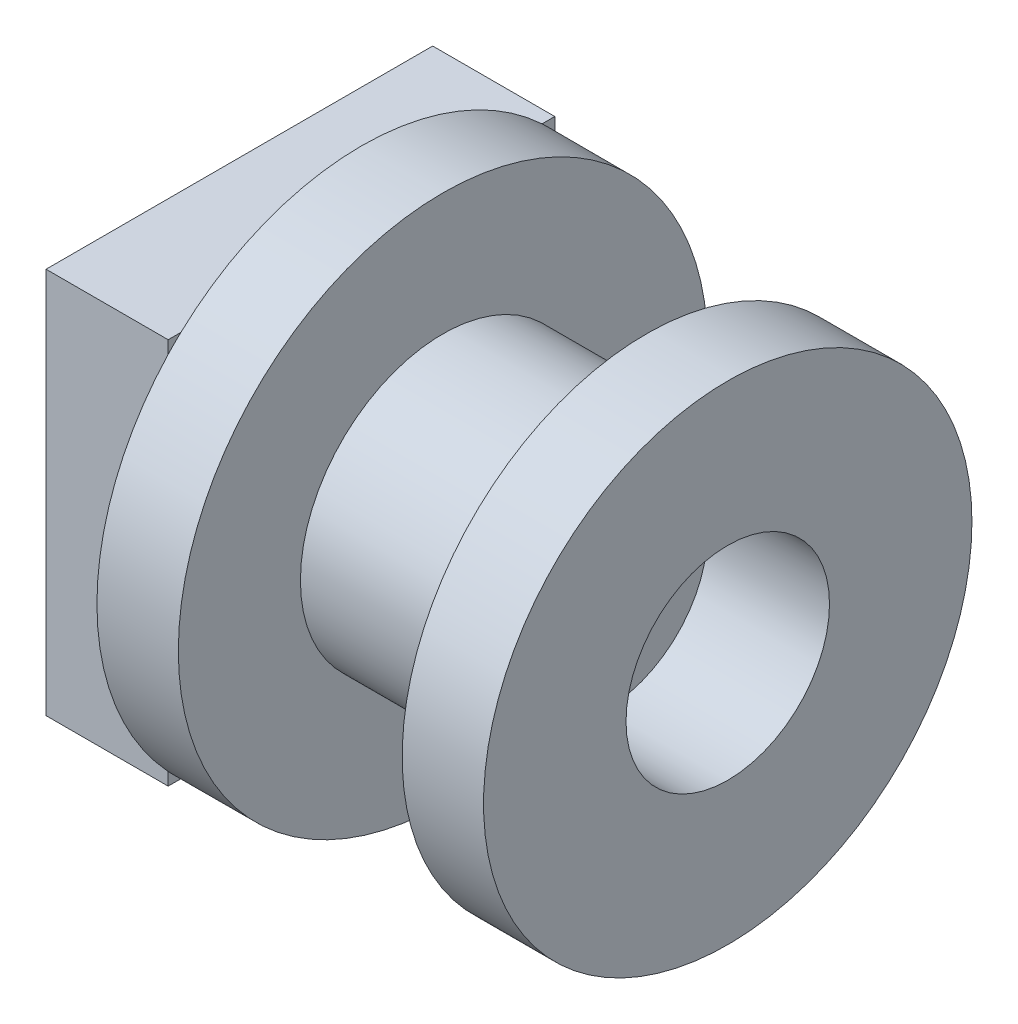
ISO-10303-21;
HEADER;
FILE_DESCRIPTION(('STEP AP214'),'2;1');
FILE_NAME('part.step','',(''),(''),'','','');
FILE_SCHEMA(('AUTOMOTIVE_DESIGN { 1 0 10303 214 1 1 1 1 }'));
ENDSEC;
DATA;
#1=APPLICATION_CONTEXT('core data for automotive mechanical design processes');
#2=APPLICATION_PROTOCOL_DEFINITION('international standard','automotive_design',2000,#1);
#3=PRODUCT_CONTEXT('',#1,'mechanical');
#4=PRODUCT('Part','Part','',(#3));
#5=PRODUCT_RELATED_PRODUCT_CATEGORY('part','',(#4));
#6=PRODUCT_DEFINITION_FORMATION('','',#4);
#7=PRODUCT_DEFINITION_CONTEXT('part definition',#1,'design');
#8=PRODUCT_DEFINITION('design','',#6,#7);
#9=PRODUCT_DEFINITION_SHAPE('','',#8);
#10=(LENGTH_UNIT() NAMED_UNIT(*) SI_UNIT(.MILLI.,.METRE.));
#11=(NAMED_UNIT(*) PLANE_ANGLE_UNIT() SI_UNIT($,.RADIAN.));
#12=(NAMED_UNIT(*) SI_UNIT($,.STERADIAN.) SOLID_ANGLE_UNIT());
#13=UNCERTAINTY_MEASURE_WITH_UNIT(LENGTH_MEASURE(1.E-05),#10,'distance_accuracy_value','');
#14=(GEOMETRIC_REPRESENTATION_CONTEXT(3) GLOBAL_UNCERTAINTY_ASSIGNED_CONTEXT((#13)) GLOBAL_UNIT_ASSIGNED_CONTEXT((#10,
#11,#12)) REPRESENTATION_CONTEXT('',''));
#15=CARTESIAN_POINT('',(0.,0.,0.));
#16=DIRECTION('',(0.,0.,1.));
#17=DIRECTION('',(1.,0.,0.));
#18=AXIS2_PLACEMENT_3D('',#15,#16,#17);
#19=CARTESIAN_POINT('',(14.,0.,0.));
#20=DIRECTION('',(1.,0.,0.));
#21=DIRECTION('',(0.,0.,-1.));
#22=AXIS2_PLACEMENT_3D('',#19,#20,#21);
#23=PLANE('',#22);
#24=CARTESIAN_POINT('',(14.,0.,0.));
#25=DIRECTION('',(1.,0.,0.));
#26=DIRECTION('',(0.,0.,-1.));
#27=AXIS2_PLACEMENT_3D('',#24,#25,#26);
#28=CIRCLE('',#27,13.);
#29=CARTESIAN_POINT('',(14.,0.,-13.));
#30=VERTEX_POINT('',#29);
#31=EDGE_CURVE('E159',#30,#30,#28,.T.);
#32=ORIENTED_EDGE('',*,*,#31,.T.);
#33=EDGE_LOOP('',(#32));
#34=FACE_BOUND('',#33,.T.);
#35=CARTESIAN_POINT('',(14.,0.,0.));
#36=DIRECTION('',(1.,0.,0.));
#37=DIRECTION('',(0.,0.,-1.));
#38=AXIS2_PLACEMENT_3D('',#35,#36,#37);
#39=CIRCLE('',#38,7.);
#40=CARTESIAN_POINT('',(14.,0.,-7.));
#41=VERTEX_POINT('',#40);
#42=EDGE_CURVE('E496',#41,#41,#39,.T.);
#43=ORIENTED_EDGE('',*,*,#42,.F.);
#44=EDGE_LOOP('',(#43));
#45=FACE_BOUND('',#44,.T.);
#46=ADVANCED_FACE('F32',(#34,#45),#23,.T.);
#47=CARTESIAN_POINT('',(10.,-9.5,9.5));
#48=DIRECTION('',(1.,0.,0.));
#49=DIRECTION('',(0.,0.,-1.));
#50=AXIS2_PLACEMENT_3D('',#47,#48,#49);
#51=PLANE('',#50);
#52=CARTESIAN_POINT('',(10.,0.,0.));
#53=DIRECTION('',(1.,0.,0.));
#54=DIRECTION('',(0.,0.,-1.));
#55=AXIS2_PLACEMENT_3D('',#52,#53,#54);
#56=CIRCLE('',#55,13.);
#57=CARTESIAN_POINT('',(10.,8.87411967464942,-9.5));
#58=VERTEX_POINT('',#57);
#59=CARTESIAN_POINT('',(10.,9.5,-8.87411967464943));
#60=VERTEX_POINT('',#59);
#61=EDGE_CURVE('E150',#58,#60,#56,.T.);
#62=ORIENTED_EDGE('',*,*,#61,.F.);
#63=DIRECTION('',(0.,1.,0.));
#64=VECTOR('',#63,1.);
#65=CARTESIAN_POINT('',(10.,9.5,-9.5));
#66=LINE('',#65,#64);
#67=CARTESIAN_POINT('',(10.,9.5,-9.5));
#68=VERTEX_POINT('',#67);
#69=EDGE_CURVE('E136',#58,#68,#66,.T.);
#70=ORIENTED_EDGE('',*,*,#69,.T.);
#71=DIRECTION('',(0.,0.,1.));
#72=VECTOR('',#71,1.);
#73=CARTESIAN_POINT('',(10.,9.5,9.5));
#74=LINE('',#73,#72);
#75=EDGE_CURVE('E182',#68,#60,#74,.T.);
#76=ORIENTED_EDGE('',*,*,#75,.T.);
#77=EDGE_LOOP('',(#62,#70,#76));
#78=FACE_BOUND('',#77,.T.);
#79=ADVANCED_FACE('F255',(#78),#51,.T.);
#80=CARTESIAN_POINT('',(10.,9.5,8.87411967464942));
#81=VERTEX_POINT('',#80);
#82=CARTESIAN_POINT('',(10.,8.87411967464942,9.5));
#83=VERTEX_POINT('',#82);
#84=EDGE_CURVE('E11',#81,#83,#56,.T.);
#85=ORIENTED_EDGE('',*,*,#84,.F.);
#86=CARTESIAN_POINT('',(10.,9.5,9.5));
#87=VERTEX_POINT('',#86);
#88=EDGE_CURVE('E133',#81,#87,#74,.T.);
#89=ORIENTED_EDGE('',*,*,#88,.T.);
#90=DIRECTION('',(0.,-1.,0.));
#91=VECTOR('',#90,1.);
#92=CARTESIAN_POINT('',(10.,9.5,9.5));
#93=LINE('',#92,#91);
#94=EDGE_CURVE('E174',#87,#83,#93,.T.);
#95=ORIENTED_EDGE('',*,*,#94,.T.);
#96=EDGE_LOOP('',(#85,#89,#95));
#97=FACE_BOUND('',#96,.T.);
#98=ADVANCED_FACE('F261',(#97),#51,.T.);
#99=CARTESIAN_POINT('',(10.,-8.87411967464942,9.5));
#100=VERTEX_POINT('',#99);
#101=CARTESIAN_POINT('',(10.,-9.5,8.87411967464943));
#102=VERTEX_POINT('',#101);
#103=EDGE_CURVE('E41',#100,#102,#56,.T.);
#104=ORIENTED_EDGE('',*,*,#103,.F.);
#105=CARTESIAN_POINT('',(10.,-9.5,9.5));
#106=VERTEX_POINT('',#105);
#107=EDGE_CURVE('E175',#100,#106,#93,.T.);
#108=ORIENTED_EDGE('',*,*,#107,.T.);
#109=DIRECTION('',(0.,0.,-1.));
#110=VECTOR('',#109,1.);
#111=CARTESIAN_POINT('',(10.,-9.5,9.5));
#112=LINE('',#111,#110);
#113=EDGE_CURVE('E178',#106,#102,#112,.T.);
#114=ORIENTED_EDGE('',*,*,#113,.T.);
#115=EDGE_LOOP('',(#104,#108,#114));
#116=FACE_BOUND('',#115,.T.);
#117=ADVANCED_FACE('F253',(#116),#51,.T.);
#118=CARTESIAN_POINT('',(4.,-1.5,1.5));
#119=DIRECTION('',(0.,0.,-1.));
#120=DIRECTION('',(-1.,0.,0.));
#121=AXIS2_PLACEMENT_3D('',#118,#119,#120);
#122=PLANE('',#121);
#123=DIRECTION('',(0.,-1.,0.));
#124=VECTOR('',#123,1.);
#125=CARTESIAN_POINT('',(0.,-1.5,1.5));
#126=LINE('',#125,#124);
#127=CARTESIAN_POINT('',(0.,1.5,1.5));
#128=VERTEX_POINT('',#127);
#129=CARTESIAN_POINT('',(0.,-1.5,1.5));
#130=VERTEX_POINT('',#129);
#131=EDGE_CURVE('E202',#128,#130,#126,.T.);
#132=ORIENTED_EDGE('',*,*,#131,.T.);
#133=DIRECTION('',(-1.,0.,0.));
#134=VECTOR('',#133,1.);
#135=CARTESIAN_POINT('',(4.,-1.5,1.5));
#136=LINE('',#135,#134);
#137=CARTESIAN_POINT('',(4.,-1.5,1.5));
#138=VERTEX_POINT('',#137);
#139=EDGE_CURVE('E36',#138,#130,#136,.T.);
#140=ORIENTED_EDGE('',*,*,#139,.F.);
#141=DIRECTION('',(0.,-1.,0.));
#142=VECTOR('',#141,1.);
#143=CARTESIAN_POINT('',(4.,-1.5,1.5));
#144=LINE('',#143,#142);
#145=CARTESIAN_POINT('',(4.,1.5,1.5));
#146=VERTEX_POINT('',#145);
#147=EDGE_CURVE('E203',#146,#138,#144,.T.);
#148=ORIENTED_EDGE('',*,*,#147,.F.);
#149=DIRECTION('',(-1.,0.,0.));
#150=VECTOR('',#149,1.);
#151=CARTESIAN_POINT('',(4.,1.5,1.5));
#152=LINE('',#151,#150);
#153=EDGE_CURVE('E216',#146,#128,#152,.T.);
#154=ORIENTED_EDGE('',*,*,#153,.T.);
#155=EDGE_LOOP('',(#132,#140,#148,#154));
#156=FACE_BOUND('',#155,.T.);
#157=ADVANCED_FACE('F34',(#156),#122,.F.);
#158=CARTESIAN_POINT('',(4.,-1.5,1.5));
#159=DIRECTION('',(0.,1.,0.));
#160=DIRECTION('',(0.,0.,1.));
#161=AXIS2_PLACEMENT_3D('',#158,#159,#160);
#162=PLANE('',#161);
#163=DIRECTION('',(0.,0.,-1.));
#164=VECTOR('',#163,1.);
#165=CARTESIAN_POINT('',(0.,-1.5,1.5));
#166=LINE('',#165,#164);
#167=CARTESIAN_POINT('',(0.,-1.5,-1.5));
#168=VERTEX_POINT('',#167);
#169=EDGE_CURVE('E219',#130,#168,#166,.T.);
#170=ORIENTED_EDGE('',*,*,#169,.T.);
#171=DIRECTION('',(-1.,0.,0.));
#172=VECTOR('',#171,1.);
#173=CARTESIAN_POINT('',(4.,-1.5,-1.5));
#174=LINE('',#173,#172);
#175=CARTESIAN_POINT('',(4.,-1.5,-1.5));
#176=VERTEX_POINT('',#175);
#177=EDGE_CURVE('E156',#176,#168,#174,.T.);
#178=ORIENTED_EDGE('',*,*,#177,.F.);
#179=DIRECTION('',(0.,0.,-1.));
#180=VECTOR('',#179,1.);
#181=CARTESIAN_POINT('',(4.,-1.5,1.5));
#182=LINE('',#181,#180);
#183=EDGE_CURVE('E206',#138,#176,#182,.T.);
#184=ORIENTED_EDGE('',*,*,#183,.F.);
#185=ORIENTED_EDGE('',*,*,#139,.T.);
#186=EDGE_LOOP('',(#170,#178,#184,#185));
#187=FACE_BOUND('',#186,.T.);
#188=ADVANCED_FACE('F246',(#187),#162,.F.);
#189=CARTESIAN_POINT('',(4.,-1.5,-1.5));
#190=DIRECTION('',(0.,0.,1.));
#191=DIRECTION('',(1.,0.,0.));
#192=AXIS2_PLACEMENT_3D('',#189,#190,#191);
#193=PLANE('',#192);
#194=DIRECTION('',(0.,1.,0.));
#195=VECTOR('',#194,1.);
#196=CARTESIAN_POINT('',(0.,-1.5,-1.5));
#197=LINE('',#196,#195);
#198=CARTESIAN_POINT('',(0.,1.5,-1.5));
#199=VERTEX_POINT('',#198);
#200=EDGE_CURVE('E221',#168,#199,#197,.T.);
#201=ORIENTED_EDGE('',*,*,#200,.T.);
#202=DIRECTION('',(-1.,0.,0.));
#203=VECTOR('',#202,1.);
#204=CARTESIAN_POINT('',(4.,1.5,-1.5));
#205=LINE('',#204,#203);
#206=CARTESIAN_POINT('',(4.,1.5,-1.5));
#207=VERTEX_POINT('',#206);
#208=EDGE_CURVE('E226',#207,#199,#205,.T.);
#209=ORIENTED_EDGE('',*,*,#208,.F.);
#210=DIRECTION('',(0.,1.,0.));
#211=VECTOR('',#210,1.);
#212=CARTESIAN_POINT('',(4.,-1.5,-1.5));
#213=LINE('',#212,#211);
#214=EDGE_CURVE('E210',#176,#207,#213,.T.);
#215=ORIENTED_EDGE('',*,*,#214,.F.);
#216=ORIENTED_EDGE('',*,*,#177,.T.);
#217=EDGE_LOOP('',(#201,#209,#215,#216));
#218=FACE_BOUND('',#217,.T.);
#219=ADVANCED_FACE('F232',(#218),#193,.F.);
#220=CARTESIAN_POINT('',(4.,1.5,1.5));
#221=DIRECTION('',(0.,-1.,0.));
#222=DIRECTION('',(0.,0.,-1.));
#223=AXIS2_PLACEMENT_3D('',#220,#221,#222);
#224=PLANE('',#223);
#225=DIRECTION('',(0.,0.,1.));
#226=VECTOR('',#225,1.);
#227=CARTESIAN_POINT('',(0.,1.5,1.5));
#228=LINE('',#227,#226);
#229=EDGE_CURVE('E207',#199,#128,#228,.T.);
#230=ORIENTED_EDGE('',*,*,#229,.T.);
#231=ORIENTED_EDGE('',*,*,#153,.F.);
#232=DIRECTION('',(0.,0.,1.));
#233=VECTOR('',#232,1.);
#234=CARTESIAN_POINT('',(4.,1.5,1.5));
#235=LINE('',#234,#233);
#236=EDGE_CURVE('E213',#207,#146,#235,.T.);
#237=ORIENTED_EDGE('',*,*,#236,.F.);
#238=ORIENTED_EDGE('',*,*,#208,.T.);
#239=EDGE_LOOP('',(#230,#231,#237,#238));
#240=FACE_BOUND('',#239,.T.);
#241=ADVANCED_FACE('F240',(#240),#224,.F.);
#242=CARTESIAN_POINT('',(0.,1.5,1.5));
#243=DIRECTION('',(-1.,0.,0.));
#244=DIRECTION('',(0.,0.,1.));
#245=AXIS2_PLACEMENT_3D('',#242,#243,#244);
#246=PLANE('',#245);
#247=ORIENTED_EDGE('',*,*,#131,.F.);
#248=ORIENTED_EDGE('',*,*,#229,.F.);
#249=ORIENTED_EDGE('',*,*,#200,.F.);
#250=ORIENTED_EDGE('',*,*,#169,.F.);
#251=EDGE_LOOP('',(#247,#248,#249,#250));
#252=FACE_BOUND('',#251,.T.);
#253=ADVANCED_FACE('F237',(#252),#246,.T.);
#254=CARTESIAN_POINT('',(4.,-9.5,9.5));
#255=DIRECTION('',(1.,0.,0.));
#256=DIRECTION('',(0.,0.,-1.));
#257=AXIS2_PLACEMENT_3D('',#254,#255,#256);
#258=PLANE('',#257);
#259=DIRECTION('',(0.,-1.,0.));
#260=VECTOR('',#259,1.);
#261=CARTESIAN_POINT('',(4.,9.5,9.5));
#262=LINE('',#261,#260);
#263=CARTESIAN_POINT('',(4.,9.5,9.5));
#264=VERTEX_POINT('',#263);
#265=CARTESIAN_POINT('',(4.,-9.5,9.5));
#266=VERTEX_POINT('',#265);
#267=EDGE_CURVE('E162',#264,#266,#262,.T.);
#268=ORIENTED_EDGE('',*,*,#267,.F.);
#269=DIRECTION('',(0.,0.,1.));
#270=VECTOR('',#269,1.);
#271=CARTESIAN_POINT('',(4.,9.5,9.5));
#272=LINE('',#271,#270);
#273=CARTESIAN_POINT('',(4.,9.5,-9.5));
#274=VERTEX_POINT('',#273);
#275=EDGE_CURVE('E176',#274,#264,#272,.T.);
#276=ORIENTED_EDGE('',*,*,#275,.F.);
#277=DIRECTION('',(0.,1.,0.));
#278=VECTOR('',#277,1.);
#279=CARTESIAN_POINT('',(4.,9.5,-9.5));
#280=LINE('',#279,#278);
#281=CARTESIAN_POINT('',(4.,-9.5,-9.5));
#282=VERTEX_POINT('',#281);
#283=EDGE_CURVE('E189',#282,#274,#280,.T.);
#284=ORIENTED_EDGE('',*,*,#283,.F.);
#285=DIRECTION('',(0.,0.,-1.));
#286=VECTOR('',#285,1.);
#287=CARTESIAN_POINT('',(4.,-9.5,9.5));
#288=LINE('',#287,#286);
#289=EDGE_CURVE('E187',#266,#282,#288,.T.);
#290=ORIENTED_EDGE('',*,*,#289,.F.);
#291=EDGE_LOOP('',(#268,#276,#284,#290));
#292=FACE_BOUND('',#291,.T.);
#293=ORIENTED_EDGE('',*,*,#236,.T.);
#294=ORIENTED_EDGE('',*,*,#147,.T.);
#295=ORIENTED_EDGE('',*,*,#183,.T.);
#296=ORIENTED_EDGE('',*,*,#214,.T.);
#297=EDGE_LOOP('',(#293,#294,#295,#296));
#298=FACE_BOUND('',#297,.T.);
#299=ADVANCED_FACE('F245',(#292,#298),#258,.F.);
#300=CARTESIAN_POINT('',(10.,9.5,9.5));
#301=DIRECTION('',(0.,0.,-1.));
#302=DIRECTION('',(-1.,0.,0.));
#303=AXIS2_PLACEMENT_3D('',#300,#301,#302);
#304=PLANE('',#303);
#305=ORIENTED_EDGE('',*,*,#267,.T.);
#306=DIRECTION('',(-1.,0.,0.));
#307=VECTOR('',#306,1.);
#308=CARTESIAN_POINT('',(10.,-9.5,9.5));
#309=LINE('',#308,#307);
#310=EDGE_CURVE('E199',#106,#266,#309,.T.);
#311=ORIENTED_EDGE('',*,*,#310,.F.);
#312=ORIENTED_EDGE('',*,*,#107,.F.);
#313=EDGE_CURVE('E170',#83,#100,#93,.T.);
#314=ORIENTED_EDGE('',*,*,#313,.F.);
#315=ORIENTED_EDGE('',*,*,#94,.F.);
#316=DIRECTION('',(-1.,0.,0.));
#317=VECTOR('',#316,1.);
#318=CARTESIAN_POINT('',(10.,9.5,9.5));
#319=LINE('',#318,#317);
#320=EDGE_CURVE('E184',#87,#264,#319,.T.);
#321=ORIENTED_EDGE('',*,*,#320,.T.);
#322=EDGE_LOOP('',(#305,#311,#312,#314,#315,#321));
#323=FACE_BOUND('',#322,.T.);
#324=ADVANCED_FACE('F280',(#323),#304,.F.);
#325=CARTESIAN_POINT('',(10.,-9.5,9.5));
#326=DIRECTION('',(0.,1.,0.));
#327=DIRECTION('',(0.,0.,1.));
#328=AXIS2_PLACEMENT_3D('',#325,#326,#327);
#329=PLANE('',#328);
#330=ORIENTED_EDGE('',*,*,#289,.T.);
#331=DIRECTION('',(-1.,0.,0.));
#332=VECTOR('',#331,1.);
#333=CARTESIAN_POINT('',(10.,-9.5,-9.5));
#334=LINE('',#333,#332);
#335=CARTESIAN_POINT('',(10.,-9.5,-9.5));
#336=VERTEX_POINT('',#335);
#337=EDGE_CURVE('E197',#336,#282,#334,.T.);
#338=ORIENTED_EDGE('',*,*,#337,.F.);
#339=CARTESIAN_POINT('',(10.,-9.5,-8.87411967464943));
#340=VERTEX_POINT('',#339);
#341=EDGE_CURVE('E129',#340,#336,#112,.T.);
#342=ORIENTED_EDGE('',*,*,#341,.F.);
#343=EDGE_CURVE('E180',#102,#340,#112,.T.);
#344=ORIENTED_EDGE('',*,*,#343,.F.);
#345=ORIENTED_EDGE('',*,*,#113,.F.);
#346=ORIENTED_EDGE('',*,*,#310,.T.);
#347=EDGE_LOOP('',(#330,#338,#342,#344,#345,#346));
#348=FACE_BOUND('',#347,.T.);
#349=ADVANCED_FACE('F286',(#348),#329,.F.);
#350=CARTESIAN_POINT('',(10.,9.5,-9.5));
#351=DIRECTION('',(0.,0.,1.));
#352=DIRECTION('',(1.,0.,0.));
#353=AXIS2_PLACEMENT_3D('',#350,#351,#352);
#354=PLANE('',#353);
#355=ORIENTED_EDGE('',*,*,#283,.T.);
#356=DIRECTION('',(-1.,0.,0.));
#357=VECTOR('',#356,1.);
#358=CARTESIAN_POINT('',(10.,9.5,-9.5));
#359=LINE('',#358,#357);
#360=EDGE_CURVE('E194',#68,#274,#359,.T.);
#361=ORIENTED_EDGE('',*,*,#360,.F.);
#362=ORIENTED_EDGE('',*,*,#69,.F.);
#363=CARTESIAN_POINT('',(10.,-8.87411967464942,-9.5));
#364=VERTEX_POINT('',#363);
#365=EDGE_CURVE('E134',#364,#58,#66,.T.);
#366=ORIENTED_EDGE('',*,*,#365,.F.);
#367=EDGE_CURVE('E123',#336,#364,#66,.T.);
#368=ORIENTED_EDGE('',*,*,#367,.F.);
#369=ORIENTED_EDGE('',*,*,#337,.T.);
#370=EDGE_LOOP('',(#355,#361,#362,#366,#368,#369));
#371=FACE_BOUND('',#370,.T.);
#372=ADVANCED_FACE('F140',(#371),#354,.F.);
#373=CARTESIAN_POINT('',(10.,9.5,9.5));
#374=DIRECTION('',(0.,-1.,0.));
#375=DIRECTION('',(0.,0.,-1.));
#376=AXIS2_PLACEMENT_3D('',#373,#374,#375);
#377=PLANE('',#376);
#378=ORIENTED_EDGE('',*,*,#275,.T.);
#379=ORIENTED_EDGE('',*,*,#320,.F.);
#380=ORIENTED_EDGE('',*,*,#88,.F.);
#381=EDGE_CURVE('E55',#60,#81,#74,.T.);
#382=ORIENTED_EDGE('',*,*,#381,.F.);
#383=ORIENTED_EDGE('',*,*,#75,.F.);
#384=ORIENTED_EDGE('',*,*,#360,.T.);
#385=EDGE_LOOP('',(#378,#379,#380,#382,#383,#384));
#386=FACE_BOUND('',#385,.T.);
#387=ADVANCED_FACE('F277',(#386),#377,.F.);
#388=EDGE_CURVE('E127',#340,#364,#56,.T.);
#389=ORIENTED_EDGE('',*,*,#388,.F.);
#390=ORIENTED_EDGE('',*,*,#341,.T.);
#391=ORIENTED_EDGE('',*,*,#367,.T.);
#392=EDGE_LOOP('',(#389,#390,#391));
#393=FACE_BOUND('',#392,.T.);
#394=ADVANCED_FACE('F125',(#393),#51,.T.);
#395=CARTESIAN_POINT('',(10.,0.,0.));
#396=DIRECTION('',(1.,0.,0.));
#397=DIRECTION('',(0.,0.,-1.));
#398=AXIS2_PLACEMENT_3D('',#395,#396,#397);
#399=PLANE('',#398);
#400=EDGE_CURVE('E163',#83,#100,#56,.T.);
#401=ORIENTED_EDGE('',*,*,#400,.F.);
#402=ORIENTED_EDGE('',*,*,#313,.T.);
#403=EDGE_LOOP('',(#401,#402));
#404=FACE_BOUND('',#403,.T.);
#405=ADVANCED_FACE('F169',(#404),#399,.F.);
#406=EDGE_CURVE('E148',#102,#340,#56,.T.);
#407=ORIENTED_EDGE('',*,*,#406,.F.);
#408=ORIENTED_EDGE('',*,*,#343,.T.);
#409=EDGE_LOOP('',(#407,#408));
#410=FACE_BOUND('',#409,.T.);
#411=ADVANCED_FACE('F271',(#410),#399,.F.);
#412=EDGE_CURVE('E144',#364,#58,#56,.T.);
#413=ORIENTED_EDGE('',*,*,#412,.F.);
#414=ORIENTED_EDGE('',*,*,#365,.T.);
#415=EDGE_LOOP('',(#413,#414));
#416=FACE_BOUND('',#415,.T.);
#417=ADVANCED_FACE('F145',(#416),#399,.F.);
#418=EDGE_CURVE('E43',#60,#81,#56,.T.);
#419=ORIENTED_EDGE('',*,*,#418,.F.);
#420=ORIENTED_EDGE('',*,*,#381,.T.);
#421=EDGE_LOOP('',(#419,#420));
#422=FACE_BOUND('',#421,.T.);
#423=ADVANCED_FACE('F272',(#422),#399,.F.);
#424=CARTESIAN_POINT('',(14.,0.,0.));
#425=DIRECTION('',(-1.,0.,0.));
#426=DIRECTION('',(0.,0.,1.));
#427=AXIS2_PLACEMENT_3D('',#424,#425,#426);
#428=CYLINDRICAL_SURFACE('',#427,13.);
#429=ORIENTED_EDGE('',*,*,#31,.F.);
#430=EDGE_LOOP('',(#429));
#431=FACE_BOUND('',#430,.T.);
#432=ORIENTED_EDGE('',*,*,#61,.T.);
#433=ORIENTED_EDGE('',*,*,#418,.T.);
#434=ORIENTED_EDGE('',*,*,#84,.T.);
#435=ORIENTED_EDGE('',*,*,#400,.T.);
#436=ORIENTED_EDGE('',*,*,#103,.T.);
#437=ORIENTED_EDGE('',*,*,#406,.T.);
#438=ORIENTED_EDGE('',*,*,#388,.T.);
#439=ORIENTED_EDGE('',*,*,#412,.T.);
#440=EDGE_LOOP('',(#432,#433,#434,#435,#436,#437,#438,#439));
#441=FACE_BOUND('',#440,.T.);
#442=ADVANCED_FACE('F152',(#431,#441),#428,.T.);
#443=CARTESIAN_POINT('',(24.,0.,0.));
#444=DIRECTION('',(-1.,0.,0.));
#445=DIRECTION('',(0.,0.,1.));
#446=AXIS2_PLACEMENT_3D('',#443,#444,#445);
#447=CYLINDRICAL_SURFACE('',#446,7.);
#448=CARTESIAN_POINT('',(24.,0.,0.));
#449=DIRECTION('',(1.,0.,0.));
#450=DIRECTION('',(0.,0.,-1.));
#451=AXIS2_PLACEMENT_3D('',#448,#449,#450);
#452=CIRCLE('',#451,7.);
#453=CARTESIAN_POINT('',(24.,0.,-7.));
#454=VERTEX_POINT('',#453);
#455=EDGE_CURVE('E149',#454,#454,#452,.T.);
#456=ORIENTED_EDGE('',*,*,#455,.F.);
#457=EDGE_LOOP('',(#456));
#458=FACE_BOUND('',#457,.T.);
#459=ORIENTED_EDGE('',*,*,#42,.T.);
#460=EDGE_LOOP('',(#459));
#461=FACE_BOUND('',#460,.T.);
#462=ADVANCED_FACE('F267',(#458,#461),#447,.T.);
#463=CARTESIAN_POINT('',(24.,0.,0.));
#464=DIRECTION('',(1.,0.,0.));
#465=DIRECTION('',(0.,0.,-1.));
#466=AXIS2_PLACEMENT_3D('',#463,#464,#465);
#467=PLANE('',#466);
#468=CARTESIAN_POINT('',(24.,0.,0.));
#469=DIRECTION('',(1.,0.,0.));
#470=DIRECTION('',(0.,0.,-1.));
#471=AXIS2_PLACEMENT_3D('',#468,#469,#470);
#472=CIRCLE('',#471,12.);
#473=CARTESIAN_POINT('',(24.,0.,-12.));
#474=VERTEX_POINT('',#473);
#475=EDGE_CURVE('E486',#474,#474,#472,.T.);
#476=ORIENTED_EDGE('',*,*,#475,.F.);
#477=EDGE_LOOP('',(#476));
#478=FACE_BOUND('',#477,.T.);
#479=ORIENTED_EDGE('',*,*,#455,.T.);
#480=EDGE_LOOP('',(#479));
#481=FACE_BOUND('',#480,.T.);
#482=ADVANCED_FACE('F361',(#478,#481),#467,.F.);
#483=CARTESIAN_POINT('',(28.,0.,0.));
#484=DIRECTION('',(-1.,0.,0.));
#485=DIRECTION('',(0.,0.,1.));
#486=AXIS2_PLACEMENT_3D('',#483,#484,#485);
#487=CYLINDRICAL_SURFACE('',#486,12.);
#488=CARTESIAN_POINT('',(28.,0.,0.));
#489=DIRECTION('',(1.,0.,0.));
#490=DIRECTION('',(0.,0.,-1.));
#491=AXIS2_PLACEMENT_3D('',#488,#489,#490);
#492=CIRCLE('',#491,12.);
#493=CARTESIAN_POINT('',(28.,0.,-12.));
#494=VERTEX_POINT('',#493);
#495=EDGE_CURVE('E490',#494,#494,#492,.T.);
#496=ORIENTED_EDGE('',*,*,#495,.F.);
#497=EDGE_LOOP('',(#496));
#498=FACE_BOUND('',#497,.T.);
#499=ORIENTED_EDGE('',*,*,#475,.T.);
#500=EDGE_LOOP('',(#499));
#501=FACE_BOUND('',#500,.T.);
#502=ADVANCED_FACE('F368',(#498,#501),#487,.T.);
#503=CARTESIAN_POINT('',(28.,0.,0.));
#504=DIRECTION('',(1.,0.,0.));
#505=DIRECTION('',(0.,0.,-1.));
#506=AXIS2_PLACEMENT_3D('',#503,#504,#505);
#507=PLANE('',#506);
#508=CARTESIAN_POINT('',(28.,0.,0.));
#509=DIRECTION('',(1.,0.,0.));
#510=DIRECTION('',(0.,0.,-1.));
#511=AXIS2_PLACEMENT_3D('',#508,#509,#510);
#512=CIRCLE('',#511,5.);
#513=CARTESIAN_POINT('',(28.,0.,-5.));
#514=VERTEX_POINT('',#513);
#515=EDGE_CURVE('E487',#514,#514,#512,.T.);
#516=ORIENTED_EDGE('',*,*,#515,.F.);
#517=EDGE_LOOP('',(#516));
#518=FACE_BOUND('',#517,.T.);
#519=ORIENTED_EDGE('',*,*,#495,.T.);
#520=EDGE_LOOP('',(#519));
#521=FACE_BOUND('',#520,.T.);
#522=ADVANCED_FACE('F376',(#518,#521),#507,.T.);
#523=CARTESIAN_POINT('',(22.,0.,0.));
#524=DIRECTION('',(1.,0.,0.));
#525=DIRECTION('',(0.,0.,-1.));
#526=AXIS2_PLACEMENT_3D('',#523,#524,#525);
#527=CYLINDRICAL_SURFACE('',#526,5.);
#528=CARTESIAN_POINT('',(22.,0.,0.));
#529=DIRECTION('',(1.,0.,0.));
#530=DIRECTION('',(0.,0.,-1.));
#531=AXIS2_PLACEMENT_3D('',#528,#529,#530);
#532=CIRCLE('',#531,5.);
#533=CARTESIAN_POINT('',(22.,0.,-5.));
#534=VERTEX_POINT('',#533);
#535=EDGE_CURVE('E485',#534,#534,#532,.T.);
#536=ORIENTED_EDGE('',*,*,#535,.F.);
#537=EDGE_LOOP('',(#536));
#538=FACE_BOUND('',#537,.T.);
#539=ORIENTED_EDGE('',*,*,#515,.T.);
#540=EDGE_LOOP('',(#539));
#541=FACE_BOUND('',#540,.T.);
#542=ADVANCED_FACE('F383',(#538,#541),#527,.F.);
#543=CARTESIAN_POINT('',(22.,0.,0.));
#544=DIRECTION('',(1.,0.,0.));
#545=DIRECTION('',(0.,0.,-1.));
#546=AXIS2_PLACEMENT_3D('',#543,#544,#545);
#547=PLANE('',#546);
#548=ORIENTED_EDGE('',*,*,#535,.T.);
#549=EDGE_LOOP('',(#548));
#550=FACE_BOUND('',#549,.T.);
#551=ADVANCED_FACE('F391',(#550),#547,.T.);
#552=CLOSED_SHELL('',(#46,#79,#98,#117,#157,#188,#219,#241,#253,#299,#324,#349,#372,#387,#394,
#405,#411,#417,#423,#442,#462,#482,#502,#522,#542,#551));
#553=MANIFOLD_SOLID_BREP('B2',#552);
#554=ADVANCED_BREP_SHAPE_REPRESENTATION('',(#18,#553),#14);
#555=SHAPE_DEFINITION_REPRESENTATION(#9,#554);
ENDSEC;
END-ISO-10303-21;
